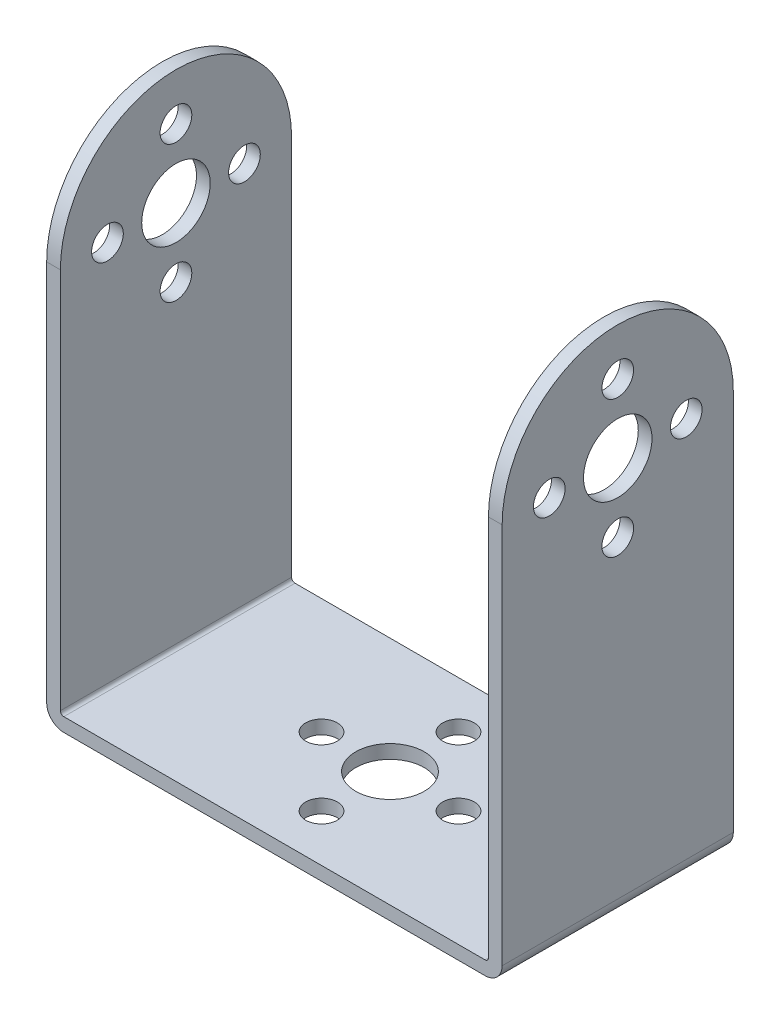
ISO-10303-21;
HEADER;
FILE_DESCRIPTION(('STEP AP214'),'2;1');
FILE_NAME('part.step','',(''),(''),'','','');
FILE_SCHEMA(('AUTOMOTIVE_DESIGN { 1 0 10303 214 1 1 1 1 }'));
ENDSEC;
DATA;
#1=APPLICATION_CONTEXT('core data for automotive mechanical design processes');
#2=APPLICATION_PROTOCOL_DEFINITION('international standard','automotive_design',2000,#1);
#3=PRODUCT_CONTEXT('',#1,'mechanical');
#4=PRODUCT('Part','Part','',(#3));
#5=PRODUCT_RELATED_PRODUCT_CATEGORY('part','',(#4));
#6=PRODUCT_DEFINITION_FORMATION('','',#4);
#7=PRODUCT_DEFINITION_CONTEXT('part definition',#1,'design');
#8=PRODUCT_DEFINITION('design','',#6,#7);
#9=PRODUCT_DEFINITION_SHAPE('','',#8);
#10=(LENGTH_UNIT() NAMED_UNIT(*) SI_UNIT(.MILLI.,.METRE.));
#11=(NAMED_UNIT(*) PLANE_ANGLE_UNIT() SI_UNIT($,.RADIAN.));
#12=(NAMED_UNIT(*) SI_UNIT($,.STERADIAN.) SOLID_ANGLE_UNIT());
#13=UNCERTAINTY_MEASURE_WITH_UNIT(LENGTH_MEASURE(1.E-05),#10,'distance_accuracy_value','');
#14=(GEOMETRIC_REPRESENTATION_CONTEXT(3) GLOBAL_UNCERTAINTY_ASSIGNED_CONTEXT((#13)) GLOBAL_UNIT_ASSIGNED_CONTEXT((#10,
#11,#12)) REPRESENTATION_CONTEXT('',''));
#15=CARTESIAN_POINT('',(0.,0.,0.));
#16=DIRECTION('',(0.,0.,1.));
#17=DIRECTION('',(1.,0.,0.));
#18=AXIS2_PLACEMENT_3D('',#15,#16,#17);
#19=CARTESIAN_POINT('',(-26.6,45.,0.));
#20=DIRECTION('',(1.,0.,0.));
#21=DIRECTION('',(0.,0.,-1.));
#22=AXIS2_PLACEMENT_3D('',#19,#20,#21);
#23=CYLINDRICAL_SURFACE('',#22,13.5);
#24=CARTESIAN_POINT('',(-25.,45.,0.));
#25=DIRECTION('',(-1.,0.,0.));
#26=DIRECTION('',(0.,-1.,0.));
#27=AXIS2_PLACEMENT_3D('',#24,#25,#26);
#28=CIRCLE('',#27,13.5);
#29=CARTESIAN_POINT('',(-25.,45.,-13.5));
#30=VERTEX_POINT('',#29);
#31=CARTESIAN_POINT('',(-25.,45.,13.5));
#32=VERTEX_POINT('',#31);
#33=EDGE_CURVE('E136',#30,#32,#28,.F.);
#34=ORIENTED_EDGE('',*,*,#33,.F.);
#35=DIRECTION('',(1.,0.,0.));
#36=VECTOR('',#35,1.);
#37=CARTESIAN_POINT('',(-26.6,45.,-13.5));
#38=LINE('',#37,#36);
#39=CARTESIAN_POINT('',(-26.6,45.,-13.5));
#40=VERTEX_POINT('',#39);
#41=EDGE_CURVE('E154',#40,#30,#38,.T.);
#42=ORIENTED_EDGE('',*,*,#41,.F.);
#43=CARTESIAN_POINT('',(-26.6,45.,0.));
#44=DIRECTION('',(1.,0.,0.));
#45=DIRECTION('',(0.,0.,-1.));
#46=AXIS2_PLACEMENT_3D('',#43,#44,#45);
#47=CIRCLE('',#46,13.5);
#48=CARTESIAN_POINT('',(-26.6,45.,13.5));
#49=VERTEX_POINT('',#48);
#50=EDGE_CURVE('E228',#40,#49,#47,.T.);
#51=ORIENTED_EDGE('',*,*,#50,.T.);
#52=DIRECTION('',(1.,0.,0.));
#53=VECTOR('',#52,1.);
#54=CARTESIAN_POINT('',(-26.6,45.,13.5));
#55=LINE('',#54,#53);
#56=EDGE_CURVE('E166',#49,#32,#55,.T.);
#57=ORIENTED_EDGE('',*,*,#56,.T.);
#58=EDGE_LOOP('',(#34,#42,#51,#57));
#59=FACE_BOUND('',#58,.T.);
#60=ADVANCED_FACE('F33',(#59),#23,.T.);
#61=CARTESIAN_POINT('',(25.,45.,0.));
#62=DIRECTION('',(1.,0.,0.));
#63=DIRECTION('',(0.,1.,0.));
#64=AXIS2_PLACEMENT_3D('',#61,#62,#63);
#65=CIRCLE('',#64,13.5);
#66=CARTESIAN_POINT('',(25.,45.,13.5));
#67=VERTEX_POINT('',#66);
#68=CARTESIAN_POINT('',(25.,45.,-13.5));
#69=VERTEX_POINT('',#68);
#70=EDGE_CURVE('E126',#67,#69,#65,.F.);
#71=ORIENTED_EDGE('',*,*,#70,.F.);
#72=CARTESIAN_POINT('',(26.6,45.,13.5));
#73=VERTEX_POINT('',#72);
#74=EDGE_CURVE('E169',#67,#73,#55,.T.);
#75=ORIENTED_EDGE('',*,*,#74,.T.);
#76=CARTESIAN_POINT('',(26.6,45.,0.));
#77=DIRECTION('',(1.,0.,0.));
#78=DIRECTION('',(0.,0.,-1.));
#79=AXIS2_PLACEMENT_3D('',#76,#77,#78);
#80=CIRCLE('',#79,13.5);
#81=CARTESIAN_POINT('',(26.6,45.,-13.5));
#82=VERTEX_POINT('',#81);
#83=EDGE_CURVE('E153',#82,#73,#80,.T.);
#84=ORIENTED_EDGE('',*,*,#83,.F.);
#85=EDGE_CURVE('E144',#69,#82,#38,.T.);
#86=ORIENTED_EDGE('',*,*,#85,.F.);
#87=EDGE_LOOP('',(#71,#75,#84,#86));
#88=FACE_BOUND('',#87,.T.);
#89=ADVANCED_FACE('F151',(#88),#23,.T.);
#90=CARTESIAN_POINT('',(-26.6,-1.6,-13.5));
#91=DIRECTION('',(0.,0.,-1.));
#92=DIRECTION('',(-1.,0.,0.));
#93=AXIS2_PLACEMENT_3D('',#90,#91,#92);
#94=PLANE('',#93);
#95=DIRECTION('',(1.,0.,0.));
#96=VECTOR('',#95,1.);
#97=CARTESIAN_POINT('',(-26.6,-1.6,-13.5));
#98=LINE('',#97,#96);
#99=CARTESIAN_POINT('',(-24.6,-1.6,-13.5));
#100=VERTEX_POINT('',#99);
#101=CARTESIAN_POINT('',(24.6,-1.6,-13.5));
#102=VERTEX_POINT('',#101);
#103=EDGE_CURVE('E155',#100,#102,#98,.T.);
#104=ORIENTED_EDGE('',*,*,#103,.F.);
#105=CARTESIAN_POINT('',(-24.6,0.4,-13.5));
#106=DIRECTION('',(0.,0.,-1.));
#107=DIRECTION('',(-1.,0.,0.));
#108=AXIS2_PLACEMENT_3D('',#105,#106,#107);
#109=CIRCLE('',#108,2.);
#110=CARTESIAN_POINT('',(-26.6,0.4,-13.5));
#111=VERTEX_POINT('',#110);
#112=EDGE_CURVE('E210',#100,#111,#109,.T.);
#113=ORIENTED_EDGE('',*,*,#112,.T.);
#114=DIRECTION('',(0.,1.,0.));
#115=VECTOR('',#114,1.);
#116=CARTESIAN_POINT('',(-26.6,-1.6,-13.5));
#117=LINE('',#116,#115);
#118=EDGE_CURVE('E223',#111,#40,#117,.T.);
#119=ORIENTED_EDGE('',*,*,#118,.T.);
#120=ORIENTED_EDGE('',*,*,#41,.T.);
#121=DIRECTION('',(0.,1.,0.));
#122=VECTOR('',#121,1.);
#123=CARTESIAN_POINT('',(-25.,0.,-13.5));
#124=LINE('',#123,#122);
#125=CARTESIAN_POINT('',(-25.,0.4,-13.5));
#126=VERTEX_POINT('',#125);
#127=EDGE_CURVE('E240',#126,#30,#124,.T.);
#128=ORIENTED_EDGE('',*,*,#127,.F.);
#129=CARTESIAN_POINT('',(-24.6,0.4,-13.5));
#130=DIRECTION('',(0.,0.,-1.));
#131=DIRECTION('',(-1.,0.,0.));
#132=AXIS2_PLACEMENT_3D('',#129,#130,#131);
#133=CIRCLE('',#132,0.4);
#134=CARTESIAN_POINT('',(-24.6,0.,-13.5));
#135=VERTEX_POINT('',#134);
#136=EDGE_CURVE('E199',#126,#135,#133,.F.);
#137=ORIENTED_EDGE('',*,*,#136,.T.);
#138=DIRECTION('',(-1.,0.,0.));
#139=VECTOR('',#138,1.);
#140=CARTESIAN_POINT('',(25.,0.,-13.5));
#141=LINE('',#140,#139);
#142=CARTESIAN_POINT('',(24.6,0.,-13.5));
#143=VERTEX_POINT('',#142);
#144=EDGE_CURVE('E148',#143,#135,#141,.T.);
#145=ORIENTED_EDGE('',*,*,#144,.F.);
#146=CARTESIAN_POINT('',(24.6,0.4,-13.5));
#147=DIRECTION('',(0.,0.,-1.));
#148=DIRECTION('',(-1.,0.,0.));
#149=AXIS2_PLACEMENT_3D('',#146,#147,#148);
#150=CIRCLE('',#149,0.4);
#151=CARTESIAN_POINT('',(25.,0.399999999999998,-13.5));
#152=VERTEX_POINT('',#151);
#153=EDGE_CURVE('E147',#143,#152,#150,.F.);
#154=ORIENTED_EDGE('',*,*,#153,.T.);
#155=DIRECTION('',(0.,-1.,0.));
#156=VECTOR('',#155,1.);
#157=CARTESIAN_POINT('',(25.,63.5,-13.5));
#158=LINE('',#157,#156);
#159=EDGE_CURVE('E129',#69,#152,#158,.T.);
#160=ORIENTED_EDGE('',*,*,#159,.F.);
#161=ORIENTED_EDGE('',*,*,#85,.T.);
#162=DIRECTION('',(0.,1.,0.));
#163=VECTOR('',#162,1.);
#164=CARTESIAN_POINT('',(26.6,-1.6,-13.5));
#165=LINE('',#164,#163);
#166=CARTESIAN_POINT('',(26.6,0.399999999999997,-13.5));
#167=VERTEX_POINT('',#166);
#168=EDGE_CURVE('E162',#167,#82,#165,.T.);
#169=ORIENTED_EDGE('',*,*,#168,.F.);
#170=CARTESIAN_POINT('',(24.6,0.399999999999998,-13.5));
#171=DIRECTION('',(0.,0.,-1.));
#172=DIRECTION('',(-1.,0.,0.));
#173=AXIS2_PLACEMENT_3D('',#170,#171,#172);
#174=CIRCLE('',#173,2.);
#175=EDGE_CURVE('E208',#167,#102,#174,.T.);
#176=ORIENTED_EDGE('',*,*,#175,.T.);
#177=EDGE_LOOP('',(#104,#113,#119,#120,#128,#137,#145,#154,#160,#161,#169,#176));
#178=FACE_BOUND('',#177,.T.);
#179=ADVANCED_FACE('F142',(#178),#94,.T.);
#180=CARTESIAN_POINT('',(-26.6,-1.6,13.5));
#181=DIRECTION('',(0.,-1.,0.));
#182=DIRECTION('',(0.,0.,-1.));
#183=AXIS2_PLACEMENT_3D('',#180,#181,#182);
#184=PLANE('',#183);
#185=CARTESIAN_POINT('',(0.,-1.6,0.));
#186=DIRECTION('',(0.,1.,0.));
#187=DIRECTION('',(0.,0.,1.));
#188=AXIS2_PLACEMENT_3D('',#185,#186,#187);
#189=CIRCLE('',#188,3.99999999999999);
#190=CARTESIAN_POINT('',(0.,-1.6,3.99999999999999));
#191=VERTEX_POINT('',#190);
#192=EDGE_CURVE('E310',#191,#191,#189,.T.);
#193=ORIENTED_EDGE('',*,*,#192,.T.);
#194=EDGE_LOOP('',(#193));
#195=FACE_BOUND('',#194,.T.);
#196=CARTESIAN_POINT('',(0.,-1.6,-8.));
#197=DIRECTION('',(0.,1.,0.));
#198=DIRECTION('',(0.,0.,1.));
#199=AXIS2_PLACEMENT_3D('',#196,#197,#198);
#200=CIRCLE('',#199,1.84999999999999);
#201=CARTESIAN_POINT('',(0.,-1.6,-6.15000000000001));
#202=VERTEX_POINT('',#201);
#203=EDGE_CURVE('E304',#202,#202,#200,.T.);
#204=ORIENTED_EDGE('',*,*,#203,.T.);
#205=EDGE_LOOP('',(#204));
#206=FACE_BOUND('',#205,.T.);
#207=CARTESIAN_POINT('',(8.,-1.6,0.));
#208=DIRECTION('',(0.,1.,0.));
#209=DIRECTION('',(0.,0.,1.));
#210=AXIS2_PLACEMENT_3D('',#207,#208,#209);
#211=CIRCLE('',#210,1.84999999999999);
#212=CARTESIAN_POINT('',(8.,-1.6,1.84999999999999));
#213=VERTEX_POINT('',#212);
#214=EDGE_CURVE('E298',#213,#213,#211,.T.);
#215=ORIENTED_EDGE('',*,*,#214,.T.);
#216=EDGE_LOOP('',(#215));
#217=FACE_BOUND('',#216,.T.);
#218=CARTESIAN_POINT('',(0.,-1.6,8.));
#219=DIRECTION('',(0.,1.,0.));
#220=DIRECTION('',(0.,0.,1.));
#221=AXIS2_PLACEMENT_3D('',#218,#219,#220);
#222=CIRCLE('',#221,1.84999999999999);
#223=CARTESIAN_POINT('',(0.,-1.6,9.84999999999999));
#224=VERTEX_POINT('',#223);
#225=EDGE_CURVE('E292',#224,#224,#222,.T.);
#226=ORIENTED_EDGE('',*,*,#225,.T.);
#227=EDGE_LOOP('',(#226));
#228=FACE_BOUND('',#227,.T.);
#229=CARTESIAN_POINT('',(-8.,-1.6,0.));
#230=DIRECTION('',(0.,1.,0.));
#231=DIRECTION('',(0.,0.,1.));
#232=AXIS2_PLACEMENT_3D('',#229,#230,#231);
#233=CIRCLE('',#232,1.84999999999999);
#234=CARTESIAN_POINT('',(-8.,-1.6,1.84999999999999));
#235=VERTEX_POINT('',#234);
#236=EDGE_CURVE('E286',#235,#235,#233,.T.);
#237=ORIENTED_EDGE('',*,*,#236,.T.);
#238=EDGE_LOOP('',(#237));
#239=FACE_BOUND('',#238,.T.);
#240=DIRECTION('',(1.,0.,0.));
#241=VECTOR('',#240,1.);
#242=CARTESIAN_POINT('',(-26.6,-1.6,13.5));
#243=LINE('',#242,#241);
#244=CARTESIAN_POINT('',(-24.6,-1.6,13.5));
#245=VERTEX_POINT('',#244);
#246=CARTESIAN_POINT('',(24.6,-1.6,13.5));
#247=VERTEX_POINT('',#246);
#248=EDGE_CURVE('E159',#245,#247,#243,.T.);
#249=ORIENTED_EDGE('',*,*,#248,.F.);
#250=DIRECTION('',(0.,0.,-1.));
#251=VECTOR('',#250,1.);
#252=CARTESIAN_POINT('',(-24.6,-1.6,-13.5));
#253=LINE('',#252,#251);
#254=EDGE_CURVE('E205',#245,#100,#253,.T.);
#255=ORIENTED_EDGE('',*,*,#254,.T.);
#256=ORIENTED_EDGE('',*,*,#103,.T.);
#257=DIRECTION('',(0.,0.,-1.));
#258=VECTOR('',#257,1.);
#259=CARTESIAN_POINT('',(24.6,-1.6,13.5));
#260=LINE('',#259,#258);
#261=EDGE_CURVE('E203',#102,#247,#260,.F.);
#262=ORIENTED_EDGE('',*,*,#261,.T.);
#263=EDGE_LOOP('',(#249,#255,#256,#262));
#264=FACE_BOUND('',#263,.T.);
#265=ADVANCED_FACE('F220',(#195,#206,#217,#228,#239,#264),#184,.T.);
#266=CARTESIAN_POINT('',(-26.6,45.,13.5));
#267=DIRECTION('',(0.,0.,1.));
#268=DIRECTION('',(1.,0.,0.));
#269=AXIS2_PLACEMENT_3D('',#266,#267,#268);
#270=PLANE('',#269);
#271=DIRECTION('',(0.,-1.,0.));
#272=VECTOR('',#271,1.);
#273=CARTESIAN_POINT('',(-26.6,45.,13.5));
#274=LINE('',#273,#272);
#275=CARTESIAN_POINT('',(-26.6,0.399999999999998,13.5));
#276=VERTEX_POINT('',#275);
#277=EDGE_CURVE('E216',#49,#276,#274,.T.);
#278=ORIENTED_EDGE('',*,*,#277,.T.);
#279=CARTESIAN_POINT('',(-24.6,0.4,13.5));
#280=DIRECTION('',(0.,0.,1.));
#281=DIRECTION('',(1.,0.,0.));
#282=AXIS2_PLACEMENT_3D('',#279,#280,#281);
#283=CIRCLE('',#282,2.);
#284=EDGE_CURVE('E41',#276,#245,#283,.T.);
#285=ORIENTED_EDGE('',*,*,#284,.T.);
#286=ORIENTED_EDGE('',*,*,#248,.T.);
#287=CARTESIAN_POINT('',(24.6,0.399999999999998,13.5));
#288=DIRECTION('',(0.,0.,1.));
#289=DIRECTION('',(1.,0.,0.));
#290=AXIS2_PLACEMENT_3D('',#287,#288,#289);
#291=CIRCLE('',#290,2.);
#292=CARTESIAN_POINT('',(26.6,0.399999999999998,13.5));
#293=VERTEX_POINT('',#292);
#294=EDGE_CURVE('E48',#247,#293,#291,.T.);
#295=ORIENTED_EDGE('',*,*,#294,.T.);
#296=DIRECTION('',(0.,-1.,0.));
#297=VECTOR('',#296,1.);
#298=CARTESIAN_POINT('',(26.6,45.,13.5));
#299=LINE('',#298,#297);
#300=EDGE_CURVE('E233',#73,#293,#299,.T.);
#301=ORIENTED_EDGE('',*,*,#300,.F.);
#302=ORIENTED_EDGE('',*,*,#74,.F.);
#303=DIRECTION('',(0.,1.,0.));
#304=VECTOR('',#303,1.);
#305=CARTESIAN_POINT('',(25.,45.,13.5));
#306=LINE('',#305,#304);
#307=CARTESIAN_POINT('',(25.,0.399999999999998,13.5));
#308=VERTEX_POINT('',#307);
#309=EDGE_CURVE('E132',#308,#67,#306,.T.);
#310=ORIENTED_EDGE('',*,*,#309,.F.);
#311=CARTESIAN_POINT('',(24.6,0.4,13.5));
#312=DIRECTION('',(0.,0.,1.));
#313=DIRECTION('',(1.,0.,0.));
#314=AXIS2_PLACEMENT_3D('',#311,#312,#313);
#315=CIRCLE('',#314,0.4);
#316=CARTESIAN_POINT('',(24.6,0.,13.5));
#317=VERTEX_POINT('',#316);
#318=EDGE_CURVE('E197',#308,#317,#315,.F.);
#319=ORIENTED_EDGE('',*,*,#318,.T.);
#320=DIRECTION('',(-1.,0.,0.));
#321=VECTOR('',#320,1.);
#322=CARTESIAN_POINT('',(25.,0.,13.5));
#323=LINE('',#322,#321);
#324=CARTESIAN_POINT('',(-24.6,0.,13.5));
#325=VERTEX_POINT('',#324);
#326=EDGE_CURVE('E242',#317,#325,#323,.T.);
#327=ORIENTED_EDGE('',*,*,#326,.T.);
#328=CARTESIAN_POINT('',(-24.6,0.4,13.5));
#329=DIRECTION('',(0.,0.,1.));
#330=DIRECTION('',(1.,0.,0.));
#331=AXIS2_PLACEMENT_3D('',#328,#329,#330);
#332=CIRCLE('',#331,0.4);
#333=CARTESIAN_POINT('',(-25.,0.4,13.5));
#334=VERTEX_POINT('',#333);
#335=EDGE_CURVE('E201',#325,#334,#332,.F.);
#336=ORIENTED_EDGE('',*,*,#335,.T.);
#337=DIRECTION('',(0.,1.,0.));
#338=VECTOR('',#337,1.);
#339=CARTESIAN_POINT('',(-25.,0.,13.5));
#340=LINE('',#339,#338);
#341=EDGE_CURVE('E137',#334,#32,#340,.T.);
#342=ORIENTED_EDGE('',*,*,#341,.T.);
#343=ORIENTED_EDGE('',*,*,#56,.F.);
#344=EDGE_LOOP('',(#278,#285,#286,#295,#301,#302,#310,#319,#327,#336,#342,#343));
#345=FACE_BOUND('',#344,.T.);
#346=ADVANCED_FACE('F215',(#345),#270,.T.);
#347=CARTESIAN_POINT('',(-26.6,45.,0.));
#348=DIRECTION('',(1.,0.,0.));
#349=DIRECTION('',(0.,0.,-1.));
#350=AXIS2_PLACEMENT_3D('',#347,#348,#349);
#351=PLANE('',#350);
#352=CARTESIAN_POINT('',(-26.6,53.,0.));
#353=DIRECTION('',(-1.,0.,0.));
#354=DIRECTION('',(0.,0.,1.));
#355=AXIS2_PLACEMENT_3D('',#352,#353,#354);
#356=CIRCLE('',#355,1.84999999999998);
#357=CARTESIAN_POINT('',(-26.6,53.,1.84999999999998));
#358=VERTEX_POINT('',#357);
#359=EDGE_CURVE('E283',#358,#358,#356,.T.);
#360=ORIENTED_EDGE('',*,*,#359,.F.);
#361=EDGE_LOOP('',(#360));
#362=FACE_BOUND('',#361,.T.);
#363=CARTESIAN_POINT('',(-26.6,45.,-8.));
#364=DIRECTION('',(-1.,0.,0.));
#365=DIRECTION('',(0.,0.,1.));
#366=AXIS2_PLACEMENT_3D('',#363,#364,#365);
#367=CIRCLE('',#366,1.84999999999999);
#368=CARTESIAN_POINT('',(-26.6,45.,-6.15000000000001));
#369=VERTEX_POINT('',#368);
#370=EDGE_CURVE('E276',#369,#369,#367,.T.);
#371=ORIENTED_EDGE('',*,*,#370,.F.);
#372=EDGE_LOOP('',(#371));
#373=FACE_BOUND('',#372,.T.);
#374=CARTESIAN_POINT('',(-26.6,37.,0.));
#375=DIRECTION('',(-1.,0.,0.));
#376=DIRECTION('',(0.,0.,1.));
#377=AXIS2_PLACEMENT_3D('',#374,#375,#376);
#378=CIRCLE('',#377,1.84999999999998);
#379=CARTESIAN_POINT('',(-26.6,37.,1.84999999999998));
#380=VERTEX_POINT('',#379);
#381=EDGE_CURVE('E264',#380,#380,#378,.T.);
#382=ORIENTED_EDGE('',*,*,#381,.F.);
#383=EDGE_LOOP('',(#382));
#384=FACE_BOUND('',#383,.T.);
#385=CARTESIAN_POINT('',(-26.6,45.,8.));
#386=DIRECTION('',(-1.,0.,0.));
#387=DIRECTION('',(0.,0.,1.));
#388=AXIS2_PLACEMENT_3D('',#385,#386,#387);
#389=CIRCLE('',#388,1.84999999999999);
#390=CARTESIAN_POINT('',(-26.6,45.,9.84999999999999));
#391=VERTEX_POINT('',#390);
#392=EDGE_CURVE('E257',#391,#391,#389,.T.);
#393=ORIENTED_EDGE('',*,*,#392,.F.);
#394=EDGE_LOOP('',(#393));
#395=FACE_BOUND('',#394,.T.);
#396=CARTESIAN_POINT('',(-26.6,45.,0.));
#397=DIRECTION('',(-1.,0.,0.));
#398=DIRECTION('',(0.,0.,1.));
#399=AXIS2_PLACEMENT_3D('',#396,#397,#398);
#400=CIRCLE('',#399,3.99999999999999);
#401=CARTESIAN_POINT('',(-26.6,45.,3.99999999999999));
#402=VERTEX_POINT('',#401);
#403=EDGE_CURVE('E250',#402,#402,#400,.T.);
#404=ORIENTED_EDGE('',*,*,#403,.F.);
#405=EDGE_LOOP('',(#404));
#406=FACE_BOUND('',#405,.T.);
#407=ORIENTED_EDGE('',*,*,#118,.F.);
#408=DIRECTION('',(0.,0.,-1.));
#409=VECTOR('',#408,1.);
#410=CARTESIAN_POINT('',(-26.6,0.4,13.5));
#411=LINE('',#410,#409);
#412=EDGE_CURVE('E56',#111,#276,#411,.F.);
#413=ORIENTED_EDGE('',*,*,#412,.T.);
#414=ORIENTED_EDGE('',*,*,#277,.F.);
#415=ORIENTED_EDGE('',*,*,#50,.F.);
#416=EDGE_LOOP('',(#407,#413,#414,#415));
#417=FACE_BOUND('',#416,.T.);
#418=ADVANCED_FACE('F226',(#362,#373,#384,#395,#406,#417),#351,.F.);
#419=CARTESIAN_POINT('',(26.6,45.,0.));
#420=DIRECTION('',(1.,0.,0.));
#421=DIRECTION('',(0.,0.,-1.));
#422=AXIS2_PLACEMENT_3D('',#419,#420,#421);
#423=PLANE('',#422);
#424=CARTESIAN_POINT('',(26.6,45.,0.));
#425=DIRECTION('',(1.,0.,0.));
#426=DIRECTION('',(0.,0.,-1.));
#427=AXIS2_PLACEMENT_3D('',#424,#425,#426);
#428=CIRCLE('',#427,3.99999999999999);
#429=CARTESIAN_POINT('',(26.6,45.,-3.99999999999999));
#430=VERTEX_POINT('',#429);
#431=EDGE_CURVE('E319',#430,#430,#428,.T.);
#432=ORIENTED_EDGE('',*,*,#431,.F.);
#433=EDGE_LOOP('',(#432));
#434=FACE_BOUND('',#433,.T.);
#435=CARTESIAN_POINT('',(26.6,53.,0.));
#436=DIRECTION('',(-1.,0.,0.));
#437=DIRECTION('',(0.,0.,1.));
#438=AXIS2_PLACEMENT_3D('',#435,#436,#437);
#439=CIRCLE('',#438,1.84999999999999);
#440=CARTESIAN_POINT('',(26.6,53.,1.84999999999999));
#441=VERTEX_POINT('',#440);
#442=EDGE_CURVE('E186',#441,#441,#439,.T.);
#443=ORIENTED_EDGE('',*,*,#442,.T.);
#444=EDGE_LOOP('',(#443));
#445=FACE_BOUND('',#444,.T.);
#446=CARTESIAN_POINT('',(26.6,45.,-8.));
#447=DIRECTION('',(-1.,0.,0.));
#448=DIRECTION('',(0.,0.,1.));
#449=AXIS2_PLACEMENT_3D('',#446,#447,#448);
#450=CIRCLE('',#449,1.84999999999999);
#451=CARTESIAN_POINT('',(26.6,45.,-6.15000000000001));
#452=VERTEX_POINT('',#451);
#453=EDGE_CURVE('E273',#452,#452,#450,.T.);
#454=ORIENTED_EDGE('',*,*,#453,.T.);
#455=EDGE_LOOP('',(#454));
#456=FACE_BOUND('',#455,.T.);
#457=CARTESIAN_POINT('',(26.6,37.,0.));
#458=DIRECTION('',(-1.,0.,0.));
#459=DIRECTION('',(0.,0.,1.));
#460=AXIS2_PLACEMENT_3D('',#457,#458,#459);
#461=CIRCLE('',#460,1.84999999999999);
#462=CARTESIAN_POINT('',(26.6,37.,1.84999999999999));
#463=VERTEX_POINT('',#462);
#464=EDGE_CURVE('E181',#463,#463,#461,.T.);
#465=ORIENTED_EDGE('',*,*,#464,.T.);
#466=EDGE_LOOP('',(#465));
#467=FACE_BOUND('',#466,.T.);
#468=CARTESIAN_POINT('',(26.6,45.,8.));
#469=DIRECTION('',(-1.,0.,0.));
#470=DIRECTION('',(0.,0.,1.));
#471=AXIS2_PLACEMENT_3D('',#468,#469,#470);
#472=CIRCLE('',#471,1.84999999999999);
#473=CARTESIAN_POINT('',(26.6,45.,9.84999999999999));
#474=VERTEX_POINT('',#473);
#475=EDGE_CURVE('E176',#474,#474,#472,.T.);
#476=ORIENTED_EDGE('',*,*,#475,.T.);
#477=EDGE_LOOP('',(#476));
#478=FACE_BOUND('',#477,.T.);
#479=ORIENTED_EDGE('',*,*,#300,.T.);
#480=DIRECTION('',(0.,0.,-1.));
#481=VECTOR('',#480,1.);
#482=CARTESIAN_POINT('',(26.6,0.399999999999998,0.));
#483=LINE('',#482,#481);
#484=EDGE_CURVE('E11',#293,#167,#483,.T.);
#485=ORIENTED_EDGE('',*,*,#484,.T.);
#486=ORIENTED_EDGE('',*,*,#168,.T.);
#487=ORIENTED_EDGE('',*,*,#83,.T.);
#488=EDGE_LOOP('',(#479,#485,#486,#487));
#489=FACE_BOUND('',#488,.T.);
#490=ADVANCED_FACE('F325',(#434,#445,#456,#467,#478,#489),#423,.T.);
#491=CARTESIAN_POINT('',(-25.,0.,13.5));
#492=DIRECTION('',(-1.,0.,0.));
#493=DIRECTION('',(0.,-1.,0.));
#494=AXIS2_PLACEMENT_3D('',#491,#492,#493);
#495=PLANE('',#494);
#496=CARTESIAN_POINT('',(-25.,53.,0.));
#497=DIRECTION('',(-1.,0.,0.));
#498=DIRECTION('',(0.,-1.,0.));
#499=AXIS2_PLACEMENT_3D('',#496,#497,#498);
#500=CIRCLE('',#499,1.84999999999999);
#501=CARTESIAN_POINT('',(-25.,51.15,0.));
#502=VERTEX_POINT('',#501);
#503=EDGE_CURVE('E182',#502,#502,#500,.T.);
#504=ORIENTED_EDGE('',*,*,#503,.T.);
#505=EDGE_LOOP('',(#504));
#506=FACE_BOUND('',#505,.T.);
#507=CARTESIAN_POINT('',(-25.,45.,-8.));
#508=DIRECTION('',(-1.,0.,0.));
#509=DIRECTION('',(0.,-1.,0.));
#510=AXIS2_PLACEMENT_3D('',#507,#508,#509);
#511=CIRCLE('',#510,1.84999999999999);
#512=CARTESIAN_POINT('',(-25.,43.15,-8.));
#513=VERTEX_POINT('',#512);
#514=EDGE_CURVE('E267',#513,#513,#511,.T.);
#515=ORIENTED_EDGE('',*,*,#514,.T.);
#516=EDGE_LOOP('',(#515));
#517=FACE_BOUND('',#516,.T.);
#518=CARTESIAN_POINT('',(-25.,37.,0.));
#519=DIRECTION('',(-1.,0.,0.));
#520=DIRECTION('',(0.,-1.,0.));
#521=AXIS2_PLACEMENT_3D('',#518,#519,#520);
#522=CIRCLE('',#521,1.84999999999999);
#523=CARTESIAN_POINT('',(-25.,35.15,0.));
#524=VERTEX_POINT('',#523);
#525=EDGE_CURVE('E180',#524,#524,#522,.T.);
#526=ORIENTED_EDGE('',*,*,#525,.T.);
#527=EDGE_LOOP('',(#526));
#528=FACE_BOUND('',#527,.T.);
#529=CARTESIAN_POINT('',(-25.,45.,8.));
#530=DIRECTION('',(-1.,0.,0.));
#531=DIRECTION('',(0.,-1.,0.));
#532=AXIS2_PLACEMENT_3D('',#529,#530,#531);
#533=CIRCLE('',#532,1.84999999999999);
#534=CARTESIAN_POINT('',(-25.,43.15,8.));
#535=VERTEX_POINT('',#534);
#536=EDGE_CURVE('E175',#535,#535,#533,.T.);
#537=ORIENTED_EDGE('',*,*,#536,.T.);
#538=EDGE_LOOP('',(#537));
#539=FACE_BOUND('',#538,.T.);
#540=CARTESIAN_POINT('',(-25.,45.,0.));
#541=DIRECTION('',(-1.,0.,0.));
#542=DIRECTION('',(0.,-1.,0.));
#543=AXIS2_PLACEMENT_3D('',#540,#541,#542);
#544=CIRCLE('',#543,4.);
#545=CARTESIAN_POINT('',(-25.,41.,0.));
#546=VERTEX_POINT('',#545);
#547=EDGE_CURVE('E149',#546,#546,#544,.T.);
#548=ORIENTED_EDGE('',*,*,#547,.T.);
#549=EDGE_LOOP('',(#548));
#550=FACE_BOUND('',#549,.T.);
#551=ORIENTED_EDGE('',*,*,#341,.F.);
#552=DIRECTION('',(0.,0.,-1.));
#553=VECTOR('',#552,1.);
#554=CARTESIAN_POINT('',(-25.,0.4,-13.5));
#555=LINE('',#554,#553);
#556=EDGE_CURVE('E193',#334,#126,#555,.T.);
#557=ORIENTED_EDGE('',*,*,#556,.T.);
#558=ORIENTED_EDGE('',*,*,#127,.T.);
#559=ORIENTED_EDGE('',*,*,#33,.T.);
#560=EDGE_LOOP('',(#551,#557,#558,#559));
#561=FACE_BOUND('',#560,.T.);
#562=ADVANCED_FACE('F328',(#506,#517,#528,#539,#550,#561),#495,.F.);
#563=CARTESIAN_POINT('',(25.,0.,13.5));
#564=DIRECTION('',(0.,-1.,0.));
#565=DIRECTION('',(0.,0.,-1.));
#566=AXIS2_PLACEMENT_3D('',#563,#564,#565);
#567=PLANE('',#566);
#568=CARTESIAN_POINT('',(0.,0.,0.));
#569=DIRECTION('',(0.,1.,0.));
#570=DIRECTION('',(0.,0.,1.));
#571=AXIS2_PLACEMENT_3D('',#568,#569,#570);
#572=CIRCLE('',#571,3.99999999999999);
#573=CARTESIAN_POINT('',(0.,0.,3.99999999999999));
#574=VERTEX_POINT('',#573);
#575=EDGE_CURVE('E313',#574,#574,#572,.T.);
#576=ORIENTED_EDGE('',*,*,#575,.F.);
#577=EDGE_LOOP('',(#576));
#578=FACE_BOUND('',#577,.T.);
#579=CARTESIAN_POINT('',(0.,0.,-8.));
#580=DIRECTION('',(0.,1.,0.));
#581=DIRECTION('',(0.,0.,1.));
#582=AXIS2_PLACEMENT_3D('',#579,#580,#581);
#583=CIRCLE('',#582,1.84999999999999);
#584=CARTESIAN_POINT('',(0.,0.,-6.15000000000001));
#585=VERTEX_POINT('',#584);
#586=EDGE_CURVE('E307',#585,#585,#583,.T.);
#587=ORIENTED_EDGE('',*,*,#586,.F.);
#588=EDGE_LOOP('',(#587));
#589=FACE_BOUND('',#588,.T.);
#590=CARTESIAN_POINT('',(8.,0.,0.));
#591=DIRECTION('',(0.,1.,0.));
#592=DIRECTION('',(0.,0.,1.));
#593=AXIS2_PLACEMENT_3D('',#590,#591,#592);
#594=CIRCLE('',#593,1.84999999999999);
#595=CARTESIAN_POINT('',(8.,0.,1.84999999999999));
#596=VERTEX_POINT('',#595);
#597=EDGE_CURVE('E301',#596,#596,#594,.T.);
#598=ORIENTED_EDGE('',*,*,#597,.F.);
#599=EDGE_LOOP('',(#598));
#600=FACE_BOUND('',#599,.T.);
#601=CARTESIAN_POINT('',(0.,0.,8.));
#602=DIRECTION('',(0.,1.,0.));
#603=DIRECTION('',(0.,0.,1.));
#604=AXIS2_PLACEMENT_3D('',#601,#602,#603);
#605=CIRCLE('',#604,1.84999999999999);
#606=CARTESIAN_POINT('',(0.,0.,9.84999999999999));
#607=VERTEX_POINT('',#606);
#608=EDGE_CURVE('E295',#607,#607,#605,.T.);
#609=ORIENTED_EDGE('',*,*,#608,.F.);
#610=EDGE_LOOP('',(#609));
#611=FACE_BOUND('',#610,.T.);
#612=CARTESIAN_POINT('',(-8.,0.,0.));
#613=DIRECTION('',(0.,1.,0.));
#614=DIRECTION('',(0.,0.,1.));
#615=AXIS2_PLACEMENT_3D('',#612,#613,#614);
#616=CIRCLE('',#615,1.84999999999999);
#617=CARTESIAN_POINT('',(-8.,0.,1.84999999999999));
#618=VERTEX_POINT('',#617);
#619=EDGE_CURVE('E289',#618,#618,#616,.T.);
#620=ORIENTED_EDGE('',*,*,#619,.F.);
#621=EDGE_LOOP('',(#620));
#622=FACE_BOUND('',#621,.T.);
#623=ORIENTED_EDGE('',*,*,#326,.F.);
#624=DIRECTION('',(0.,0.,-1.));
#625=VECTOR('',#624,1.);
#626=CARTESIAN_POINT('',(24.6,0.,-13.5));
#627=LINE('',#626,#625);
#628=EDGE_CURVE('E188',#317,#143,#627,.T.);
#629=ORIENTED_EDGE('',*,*,#628,.T.);
#630=ORIENTED_EDGE('',*,*,#144,.T.);
#631=DIRECTION('',(0.,0.,-1.));
#632=VECTOR('',#631,1.);
#633=CARTESIAN_POINT('',(-24.6,0.,13.5));
#634=LINE('',#633,#632);
#635=EDGE_CURVE('E171',#135,#325,#634,.F.);
#636=ORIENTED_EDGE('',*,*,#635,.T.);
#637=EDGE_LOOP('',(#623,#629,#630,#636));
#638=FACE_BOUND('',#637,.T.);
#639=ADVANCED_FACE('F347',(#578,#589,#600,#611,#622,#638),#567,.F.);
#640=CARTESIAN_POINT('',(25.,63.5,13.5));
#641=DIRECTION('',(1.,0.,0.));
#642=DIRECTION('',(0.,1.,0.));
#643=AXIS2_PLACEMENT_3D('',#640,#641,#642);
#644=PLANE('',#643);
#645=CARTESIAN_POINT('',(25.,45.,0.));
#646=DIRECTION('',(1.,0.,0.));
#647=DIRECTION('',(0.,1.,0.));
#648=AXIS2_PLACEMENT_3D('',#645,#646,#647);
#649=CIRCLE('',#648,4.);
#650=CARTESIAN_POINT('',(25.,49.,0.));
#651=VERTEX_POINT('',#650);
#652=EDGE_CURVE('E316',#651,#651,#649,.T.);
#653=ORIENTED_EDGE('',*,*,#652,.T.);
#654=EDGE_LOOP('',(#653));
#655=FACE_BOUND('',#654,.T.);
#656=CARTESIAN_POINT('',(25.,53.,0.));
#657=DIRECTION('',(1.,0.,0.));
#658=DIRECTION('',(0.,1.,0.));
#659=AXIS2_PLACEMENT_3D('',#656,#657,#658);
#660=CIRCLE('',#659,1.84999999999999);
#661=CARTESIAN_POINT('',(25.,54.85,0.));
#662=VERTEX_POINT('',#661);
#663=EDGE_CURVE('E185',#662,#662,#660,.T.);
#664=ORIENTED_EDGE('',*,*,#663,.T.);
#665=EDGE_LOOP('',(#664));
#666=FACE_BOUND('',#665,.T.);
#667=CARTESIAN_POINT('',(25.,45.,-8.));
#668=DIRECTION('',(1.,0.,0.));
#669=DIRECTION('',(0.,1.,0.));
#670=AXIS2_PLACEMENT_3D('',#667,#668,#669);
#671=CIRCLE('',#670,1.84999999999999);
#672=CARTESIAN_POINT('',(25.,46.85,-8.));
#673=VERTEX_POINT('',#672);
#674=EDGE_CURVE('E270',#673,#673,#671,.T.);
#675=ORIENTED_EDGE('',*,*,#674,.T.);
#676=EDGE_LOOP('',(#675));
#677=FACE_BOUND('',#676,.T.);
#678=CARTESIAN_POINT('',(25.,37.,0.));
#679=DIRECTION('',(1.,0.,0.));
#680=DIRECTION('',(0.,1.,0.));
#681=AXIS2_PLACEMENT_3D('',#678,#679,#680);
#682=CIRCLE('',#681,1.84999999999999);
#683=CARTESIAN_POINT('',(25.,38.85,0.));
#684=VERTEX_POINT('',#683);
#685=EDGE_CURVE('E177',#684,#684,#682,.T.);
#686=ORIENTED_EDGE('',*,*,#685,.T.);
#687=EDGE_LOOP('',(#686));
#688=FACE_BOUND('',#687,.T.);
#689=CARTESIAN_POINT('',(25.,45.,8.));
#690=DIRECTION('',(1.,0.,0.));
#691=DIRECTION('',(0.,1.,0.));
#692=AXIS2_PLACEMENT_3D('',#689,#690,#691);
#693=CIRCLE('',#692,1.84999999999999);
#694=CARTESIAN_POINT('',(25.,46.85,8.));
#695=VERTEX_POINT('',#694);
#696=EDGE_CURVE('E172',#695,#695,#693,.T.);
#697=ORIENTED_EDGE('',*,*,#696,.T.);
#698=EDGE_LOOP('',(#697));
#699=FACE_BOUND('',#698,.T.);
#700=ORIENTED_EDGE('',*,*,#159,.T.);
#701=DIRECTION('',(0.,0.,-1.));
#702=VECTOR('',#701,1.);
#703=CARTESIAN_POINT('',(25.,0.4,13.5));
#704=LINE('',#703,#702);
#705=EDGE_CURVE('E191',#152,#308,#704,.F.);
#706=ORIENTED_EDGE('',*,*,#705,.T.);
#707=ORIENTED_EDGE('',*,*,#309,.T.);
#708=ORIENTED_EDGE('',*,*,#70,.T.);
#709=EDGE_LOOP('',(#700,#706,#707,#708));
#710=FACE_BOUND('',#709,.T.);
#711=ADVANCED_FACE('F128',(#655,#666,#677,#688,#699,#710),#644,.F.);
#712=CARTESIAN_POINT('',(-26.6,45.,0.));
#713=DIRECTION('',(-1.,0.,0.));
#714=DIRECTION('',(0.,0.,1.));
#715=AXIS2_PLACEMENT_3D('',#712,#713,#714);
#716=CYLINDRICAL_SURFACE('',#715,4.);
#717=ORIENTED_EDGE('',*,*,#547,.F.);
#718=EDGE_LOOP('',(#717));
#719=FACE_BOUND('',#718,.T.);
#720=ORIENTED_EDGE('',*,*,#403,.T.);
#721=EDGE_LOOP('',(#720));
#722=FACE_BOUND('',#721,.T.);
#723=ADVANCED_FACE('F342',(#719,#722),#716,.F.);
#724=CARTESIAN_POINT('',(-26.6,45.,8.));
#725=DIRECTION('',(-1.,0.,0.));
#726=DIRECTION('',(0.,0.,1.));
#727=AXIS2_PLACEMENT_3D('',#724,#725,#726);
#728=CYLINDRICAL_SURFACE('',#727,1.84999999999999);
#729=ORIENTED_EDGE('',*,*,#475,.F.);
#730=EDGE_LOOP('',(#729));
#731=FACE_BOUND('',#730,.T.);
#732=ORIENTED_EDGE('',*,*,#696,.F.);
#733=EDGE_LOOP('',(#732));
#734=FACE_BOUND('',#733,.T.);
#735=ADVANCED_FACE('F338',(#731,#734),#728,.F.);
#736=ORIENTED_EDGE('',*,*,#392,.T.);
#737=EDGE_LOOP('',(#736));
#738=FACE_BOUND('',#737,.T.);
#739=ORIENTED_EDGE('',*,*,#536,.F.);
#740=EDGE_LOOP('',(#739));
#741=FACE_BOUND('',#740,.T.);
#742=ADVANCED_FACE('F341',(#738,#741),#728,.F.);
#743=CARTESIAN_POINT('',(-26.6,37.,0.));
#744=DIRECTION('',(-1.,0.,0.));
#745=DIRECTION('',(0.,0.,1.));
#746=AXIS2_PLACEMENT_3D('',#743,#744,#745);
#747=CYLINDRICAL_SURFACE('',#746,1.84999999999999);
#748=ORIENTED_EDGE('',*,*,#464,.F.);
#749=EDGE_LOOP('',(#748));
#750=FACE_BOUND('',#749,.T.);
#751=ORIENTED_EDGE('',*,*,#685,.F.);
#752=EDGE_LOOP('',(#751));
#753=FACE_BOUND('',#752,.T.);
#754=ADVANCED_FACE('F565',(#750,#753),#747,.F.);
#755=ORIENTED_EDGE('',*,*,#381,.T.);
#756=EDGE_LOOP('',(#755));
#757=FACE_BOUND('',#756,.T.);
#758=ORIENTED_EDGE('',*,*,#525,.F.);
#759=EDGE_LOOP('',(#758));
#760=FACE_BOUND('',#759,.T.);
#761=ADVANCED_FACE('F556',(#757,#760),#747,.F.);
#762=CARTESIAN_POINT('',(-26.6,45.,-8.));
#763=DIRECTION('',(-1.,0.,0.));
#764=DIRECTION('',(0.,0.,1.));
#765=AXIS2_PLACEMENT_3D('',#762,#763,#764);
#766=CYLINDRICAL_SURFACE('',#765,1.84999999999999);
#767=ORIENTED_EDGE('',*,*,#453,.F.);
#768=EDGE_LOOP('',(#767));
#769=FACE_BOUND('',#768,.T.);
#770=ORIENTED_EDGE('',*,*,#674,.F.);
#771=EDGE_LOOP('',(#770));
#772=FACE_BOUND('',#771,.T.);
#773=ADVANCED_FACE('F546',(#769,#772),#766,.F.);
#774=ORIENTED_EDGE('',*,*,#370,.T.);
#775=EDGE_LOOP('',(#774));
#776=FACE_BOUND('',#775,.T.);
#777=ORIENTED_EDGE('',*,*,#514,.F.);
#778=EDGE_LOOP('',(#777));
#779=FACE_BOUND('',#778,.T.);
#780=ADVANCED_FACE('F537',(#776,#779),#766,.F.);
#781=CARTESIAN_POINT('',(-26.6,53.,0.));
#782=DIRECTION('',(-1.,0.,0.));
#783=DIRECTION('',(0.,0.,1.));
#784=AXIS2_PLACEMENT_3D('',#781,#782,#783);
#785=CYLINDRICAL_SURFACE('',#784,1.84999999999999);
#786=ORIENTED_EDGE('',*,*,#359,.T.);
#787=EDGE_LOOP('',(#786));
#788=FACE_BOUND('',#787,.T.);
#789=ORIENTED_EDGE('',*,*,#503,.F.);
#790=EDGE_LOOP('',(#789));
#791=FACE_BOUND('',#790,.T.);
#792=ADVANCED_FACE('F527',(#788,#791),#785,.F.);
#793=ORIENTED_EDGE('',*,*,#442,.F.);
#794=EDGE_LOOP('',(#793));
#795=FACE_BOUND('',#794,.T.);
#796=ORIENTED_EDGE('',*,*,#663,.F.);
#797=EDGE_LOOP('',(#796));
#798=FACE_BOUND('',#797,.T.);
#799=ADVANCED_FACE('F517',(#795,#798),#785,.F.);
#800=CARTESIAN_POINT('',(-8.,0.,0.));
#801=DIRECTION('',(0.,1.,0.));
#802=DIRECTION('',(0.,0.,1.));
#803=AXIS2_PLACEMENT_3D('',#800,#801,#802);
#804=CYLINDRICAL_SURFACE('',#803,1.84999999999999);
#805=ORIENTED_EDGE('',*,*,#236,.F.);
#806=EDGE_LOOP('',(#805));
#807=FACE_BOUND('',#806,.T.);
#808=ORIENTED_EDGE('',*,*,#619,.T.);
#809=EDGE_LOOP('',(#808));
#810=FACE_BOUND('',#809,.T.);
#811=ADVANCED_FACE('F507',(#807,#810),#804,.F.);
#812=CARTESIAN_POINT('',(0.,0.,8.));
#813=DIRECTION('',(0.,1.,0.));
#814=DIRECTION('',(0.,0.,1.));
#815=AXIS2_PLACEMENT_3D('',#812,#813,#814);
#816=CYLINDRICAL_SURFACE('',#815,1.84999999999999);
#817=ORIENTED_EDGE('',*,*,#225,.F.);
#818=EDGE_LOOP('',(#817));
#819=FACE_BOUND('',#818,.T.);
#820=ORIENTED_EDGE('',*,*,#608,.T.);
#821=EDGE_LOOP('',(#820));
#822=FACE_BOUND('',#821,.T.);
#823=ADVANCED_FACE('F497',(#819,#822),#816,.F.);
#824=CARTESIAN_POINT('',(8.,0.,0.));
#825=DIRECTION('',(0.,1.,0.));
#826=DIRECTION('',(0.,0.,1.));
#827=AXIS2_PLACEMENT_3D('',#824,#825,#826);
#828=CYLINDRICAL_SURFACE('',#827,1.84999999999999);
#829=ORIENTED_EDGE('',*,*,#214,.F.);
#830=EDGE_LOOP('',(#829));
#831=FACE_BOUND('',#830,.T.);
#832=ORIENTED_EDGE('',*,*,#597,.T.);
#833=EDGE_LOOP('',(#832));
#834=FACE_BOUND('',#833,.T.);
#835=ADVANCED_FACE('F487',(#831,#834),#828,.F.);
#836=CARTESIAN_POINT('',(0.,0.,-8.));
#837=DIRECTION('',(0.,1.,0.));
#838=DIRECTION('',(0.,0.,1.));
#839=AXIS2_PLACEMENT_3D('',#836,#837,#838);
#840=CYLINDRICAL_SURFACE('',#839,1.84999999999999);
#841=ORIENTED_EDGE('',*,*,#203,.F.);
#842=EDGE_LOOP('',(#841));
#843=FACE_BOUND('',#842,.T.);
#844=ORIENTED_EDGE('',*,*,#586,.T.);
#845=EDGE_LOOP('',(#844));
#846=FACE_BOUND('',#845,.T.);
#847=ADVANCED_FACE('F477',(#843,#846),#840,.F.);
#848=CARTESIAN_POINT('',(0.,0.,0.));
#849=DIRECTION('',(0.,1.,0.));
#850=DIRECTION('',(0.,0.,1.));
#851=AXIS2_PLACEMENT_3D('',#848,#849,#850);
#852=CYLINDRICAL_SURFACE('',#851,3.99999999999999);
#853=ORIENTED_EDGE('',*,*,#192,.F.);
#854=EDGE_LOOP('',(#853));
#855=FACE_BOUND('',#854,.T.);
#856=ORIENTED_EDGE('',*,*,#575,.T.);
#857=EDGE_LOOP('',(#856));
#858=FACE_BOUND('',#857,.T.);
#859=ADVANCED_FACE('F467',(#855,#858),#852,.F.);
#860=CARTESIAN_POINT('',(26.6,45.,0.));
#861=DIRECTION('',(1.,0.,0.));
#862=DIRECTION('',(0.,0.,-1.));
#863=AXIS2_PLACEMENT_3D('',#860,#861,#862);
#864=CYLINDRICAL_SURFACE('',#863,4.);
#865=ORIENTED_EDGE('',*,*,#652,.F.);
#866=EDGE_LOOP('',(#865));
#867=FACE_BOUND('',#866,.T.);
#868=ORIENTED_EDGE('',*,*,#431,.T.);
#869=EDGE_LOOP('',(#868));
#870=FACE_BOUND('',#869,.T.);
#871=ADVANCED_FACE('F323',(#867,#870),#864,.F.);
#872=CARTESIAN_POINT('',(24.6,0.4,13.5));
#873=DIRECTION('',(0.,0.,1.));
#874=DIRECTION('',(1.,0.,0.));
#875=AXIS2_PLACEMENT_3D('',#872,#873,#874);
#876=CYLINDRICAL_SURFACE('',#875,0.4);
#877=ORIENTED_EDGE('',*,*,#318,.F.);
#878=ORIENTED_EDGE('',*,*,#705,.F.);
#879=ORIENTED_EDGE('',*,*,#153,.F.);
#880=ORIENTED_EDGE('',*,*,#628,.F.);
#881=EDGE_LOOP('',(#877,#878,#879,#880));
#882=FACE_BOUND('',#881,.T.);
#883=ADVANCED_FACE('F369',(#882),#876,.F.);
#884=CARTESIAN_POINT('',(-24.6,0.4,13.5));
#885=DIRECTION('',(0.,0.,1.));
#886=DIRECTION('',(1.,0.,0.));
#887=AXIS2_PLACEMENT_3D('',#884,#885,#886);
#888=CYLINDRICAL_SURFACE('',#887,0.4);
#889=ORIENTED_EDGE('',*,*,#335,.F.);
#890=ORIENTED_EDGE('',*,*,#635,.F.);
#891=ORIENTED_EDGE('',*,*,#136,.F.);
#892=ORIENTED_EDGE('',*,*,#556,.F.);
#893=EDGE_LOOP('',(#889,#890,#891,#892));
#894=FACE_BOUND('',#893,.T.);
#895=ADVANCED_FACE('F372',(#894),#888,.F.);
#896=CARTESIAN_POINT('',(-24.6,0.4,13.5));
#897=DIRECTION('',(0.,0.,1.));
#898=DIRECTION('',(1.,0.,0.));
#899=AXIS2_PLACEMENT_3D('',#896,#897,#898);
#900=CYLINDRICAL_SURFACE('',#899,2.);
#901=ORIENTED_EDGE('',*,*,#284,.F.);
#902=ORIENTED_EDGE('',*,*,#412,.F.);
#903=ORIENTED_EDGE('',*,*,#112,.F.);
#904=ORIENTED_EDGE('',*,*,#254,.F.);
#905=EDGE_LOOP('',(#901,#902,#903,#904));
#906=FACE_BOUND('',#905,.T.);
#907=ADVANCED_FACE('F222',(#906),#900,.T.);
#908=CARTESIAN_POINT('',(24.6,0.399999999999998,0.));
#909=DIRECTION('',(0.,0.,-1.));
#910=DIRECTION('',(-1.,0.,0.));
#911=AXIS2_PLACEMENT_3D('',#908,#909,#910);
#912=CYLINDRICAL_SURFACE('',#911,2.);
#913=ORIENTED_EDGE('',*,*,#294,.F.);
#914=ORIENTED_EDGE('',*,*,#261,.F.);
#915=ORIENTED_EDGE('',*,*,#175,.F.);
#916=ORIENTED_EDGE('',*,*,#484,.F.);
#917=EDGE_LOOP('',(#913,#914,#915,#916));
#918=FACE_BOUND('',#917,.T.);
#919=ADVANCED_FACE('F35',(#918),#912,.T.);
#920=CLOSED_SHELL('',(#60,#89,#179,#265,#346,#418,#490,#562,#639,#711,#723,#735,#742,#754,#761,
#773,#780,#792,#799,#811,#823,#835,#847,#859,#871,#883,#895,#907,#919));
#921=MANIFOLD_SOLID_BREP('B2',#920);
#922=ADVANCED_BREP_SHAPE_REPRESENTATION('',(#18,#921),#14);
#923=SHAPE_DEFINITION_REPRESENTATION(#9,#922);
ENDSEC;
END-ISO-10303-21;
